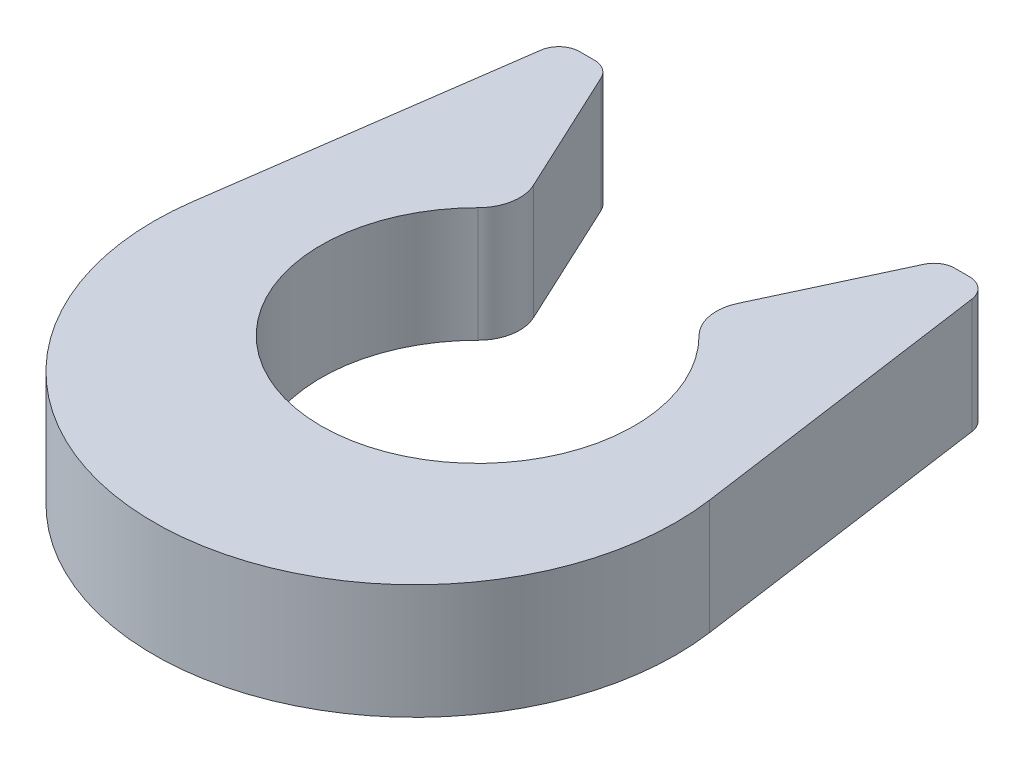
ISO-10303-21;
HEADER;
FILE_DESCRIPTION(('STEP AP214'),'2;1');
FILE_NAME('part.step','',(''),(''),'','','');
FILE_SCHEMA(('AUTOMOTIVE_DESIGN { 1 0 10303 214 1 1 1 1 }'));
ENDSEC;
DATA;
#1=APPLICATION_CONTEXT('core data for automotive mechanical design processes');
#2=APPLICATION_PROTOCOL_DEFINITION('international standard','automotive_design',2000,#1);
#3=PRODUCT_CONTEXT('',#1,'mechanical');
#4=PRODUCT('Part','Part','',(#3));
#5=PRODUCT_RELATED_PRODUCT_CATEGORY('part','',(#4));
#6=PRODUCT_DEFINITION_FORMATION('','',#4);
#7=PRODUCT_DEFINITION_CONTEXT('part definition',#1,'design');
#8=PRODUCT_DEFINITION('design','',#6,#7);
#9=PRODUCT_DEFINITION_SHAPE('','',#8);
#10=(LENGTH_UNIT() NAMED_UNIT(*) SI_UNIT(.MILLI.,.METRE.));
#11=(NAMED_UNIT(*) PLANE_ANGLE_UNIT() SI_UNIT($,.RADIAN.));
#12=(NAMED_UNIT(*) SI_UNIT($,.STERADIAN.) SOLID_ANGLE_UNIT());
#13=UNCERTAINTY_MEASURE_WITH_UNIT(LENGTH_MEASURE(1.E-05),#10,'distance_accuracy_value','');
#14=(GEOMETRIC_REPRESENTATION_CONTEXT(3) GLOBAL_UNCERTAINTY_ASSIGNED_CONTEXT((#13)) GLOBAL_UNIT_ASSIGNED_CONTEXT((#10,
#11,#12)) REPRESENTATION_CONTEXT('',''));
#15=CARTESIAN_POINT('',(0.,0.,0.));
#16=DIRECTION('',(0.,0.,1.));
#17=DIRECTION('',(1.,0.,0.));
#18=AXIS2_PLACEMENT_3D('',#15,#16,#17);
#19=CARTESIAN_POINT('',(0.,1.1,0.6));
#20=DIRECTION('',(0.,-1.,0.));
#21=DIRECTION('',(0.,0.,-1.));
#22=AXIS2_PLACEMENT_3D('',#19,#20,#21);
#23=CYLINDRICAL_SURFACE('',#22,2.5);
#24=CARTESIAN_POINT('',(0.,0.,0.6));
#25=DIRECTION('',(0.,1.,0.));
#26=DIRECTION('',(0.,0.,1.));
#27=AXIS2_PLACEMENT_3D('',#24,#25,#26);
#28=CIRCLE('',#27,2.5);
#29=CARTESIAN_POINT('',(-2.47567017185393,0.,0.252067247599854));
#30=VERTEX_POINT('',#29);
#31=CARTESIAN_POINT('',(2.47567017185393,0.,0.252067247599854));
#32=VERTEX_POINT('',#31);
#33=EDGE_CURVE('E141',#30,#32,#28,.T.);
#34=ORIENTED_EDGE('',*,*,#33,.T.);
#35=DIRECTION('',(0.,-1.,0.));
#36=VECTOR('',#35,1.);
#37=CARTESIAN_POINT('',(2.47567017185393,1.1,0.252067247599854));
#38=LINE('',#37,#36);
#39=CARTESIAN_POINT('',(2.47567017185393,1.1,0.252067247599854));
#40=VERTEX_POINT('',#39);
#41=EDGE_CURVE('E123',#40,#32,#38,.T.);
#42=ORIENTED_EDGE('',*,*,#41,.F.);
#43=CARTESIAN_POINT('',(0.,1.1,0.6));
#44=DIRECTION('',(0.,1.,0.));
#45=DIRECTION('',(0.,0.,1.));
#46=AXIS2_PLACEMENT_3D('',#43,#44,#45);
#47=CIRCLE('',#46,2.5);
#48=CARTESIAN_POINT('',(-2.47567017185393,1.1,0.252067247599854));
#49=VERTEX_POINT('',#48);
#50=EDGE_CURVE('E128',#49,#40,#47,.T.);
#51=ORIENTED_EDGE('',*,*,#50,.F.);
#52=DIRECTION('',(0.,-1.,0.));
#53=VECTOR('',#52,1.);
#54=CARTESIAN_POINT('',(-2.47567017185393,1.1,0.252067247599854));
#55=LINE('',#54,#53);
#56=EDGE_CURVE('E143',#49,#30,#55,.T.);
#57=ORIENTED_EDGE('',*,*,#56,.T.);
#58=EDGE_LOOP('',(#34,#42,#51,#57));
#59=FACE_BOUND('',#58,.T.);
#60=ADVANCED_FACE('F17',(#59),#23,.T.);
#61=CARTESIAN_POINT('',(2.04050400787065,1.1,-2.84430089981303));
#62=DIRECTION('',(-0.990268068741571,0.,0.139173100960059));
#63=DIRECTION('',(0.139173100960059,0.,0.990268068741571));
#64=AXIS2_PLACEMENT_3D('',#61,#62,#63);
#65=PLANE('',#64);
#66=DIRECTION('',(-0.139173100960059,0.,-0.990268068741571));
#67=VECTOR('',#66,1.);
#68=CARTESIAN_POINT('',(2.04050400787065,0.,-2.84430089981303));
#69=LINE('',#68,#67);
#70=CARTESIAN_POINT('',(2.06470027405571,0.,-2.67213552000503));
#71=VERTEX_POINT('',#70);
#72=EDGE_CURVE('E216',#32,#71,#69,.T.);
#73=ORIENTED_EDGE('',*,*,#72,.T.);
#74=DIRECTION('',(0.,-1.,0.));
#75=VECTOR('',#74,1.);
#76=CARTESIAN_POINT('',(2.06470027405571,1.1,-2.67213552000503));
#77=LINE('',#76,#75);
#78=CARTESIAN_POINT('',(2.06470027405571,1.1,-2.67213552000503));
#79=VERTEX_POINT('',#78);
#80=EDGE_CURVE('E126',#71,#79,#77,.F.);
#81=ORIENTED_EDGE('',*,*,#80,.T.);
#82=DIRECTION('',(-0.139173100960059,0.,-0.990268068741571));
#83=VECTOR('',#82,1.);
#84=CARTESIAN_POINT('',(2.04050400787065,1.1,-2.84430089981303));
#85=LINE('',#84,#83);
#86=EDGE_CURVE('E118',#40,#79,#85,.T.);
#87=ORIENTED_EDGE('',*,*,#86,.F.);
#88=ORIENTED_EDGE('',*,*,#41,.T.);
#89=EDGE_LOOP('',(#73,#81,#87,#88));
#90=FACE_BOUND('',#89,.T.);
#91=ADVANCED_FACE('F121',(#90),#65,.F.);
#92=CARTESIAN_POINT('',(1.6,1.1,-2.84430089981302));
#93=DIRECTION('',(0.,0.,1.));
#94=DIRECTION('',(1.,0.,0.));
#95=AXIS2_PLACEMENT_3D('',#92,#93,#94);
#96=PLANE('',#95);
#97=DIRECTION('',(-1.,0.,0.));
#98=VECTOR('',#97,1.);
#99=CARTESIAN_POINT('',(1.6,1.1,-2.84430089981302));
#100=LINE('',#99,#98);
#101=CARTESIAN_POINT('',(1.8666466603074,1.1,-2.84430089981302));
#102=VERTEX_POINT('',#101);
#103=CARTESIAN_POINT('',(1.7274140521615,1.1,-2.84430089981302));
#104=VERTEX_POINT('',#103);
#105=EDGE_CURVE('E127',#102,#104,#100,.T.);
#106=ORIENTED_EDGE('',*,*,#105,.F.);
#107=DIRECTION('',(0.,-1.,0.));
#108=VECTOR('',#107,1.);
#109=CARTESIAN_POINT('',(1.8666466603074,1.1,-2.84430089981302));
#110=LINE('',#109,#108);
#111=CARTESIAN_POINT('',(1.8666466603074,0.,-2.84430089981302));
#112=VERTEX_POINT('',#111);
#113=EDGE_CURVE('E191',#102,#112,#110,.T.);
#114=ORIENTED_EDGE('',*,*,#113,.T.);
#115=DIRECTION('',(-1.,0.,0.));
#116=VECTOR('',#115,1.);
#117=CARTESIAN_POINT('',(1.6,0.,-2.84430089981302));
#118=LINE('',#117,#116);
#119=CARTESIAN_POINT('',(1.7274140521615,0.,-2.84430089981302));
#120=VERTEX_POINT('',#119);
#121=EDGE_CURVE('E211',#112,#120,#118,.T.);
#122=ORIENTED_EDGE('',*,*,#121,.T.);
#123=DIRECTION('',(0.,-1.,0.));
#124=VECTOR('',#123,1.);
#125=CARTESIAN_POINT('',(1.7274140521615,1.1,-2.84430089981302));
#126=LINE('',#125,#124);
#127=EDGE_CURVE('E32',#120,#104,#126,.F.);
#128=ORIENTED_EDGE('',*,*,#127,.T.);
#129=EDGE_LOOP('',(#106,#114,#122,#128));
#130=FACE_BOUND('',#129,.T.);
#131=ADVANCED_FACE('F257',(#130),#96,.F.);
#132=CARTESIAN_POINT('',(0.85,1.1,-1.23592070943083));
#133=DIRECTION('',(0.906307787036652,0.,0.422618261740695));
#134=DIRECTION('',(0.422618261740695,0.,-0.906307787036652));
#135=AXIS2_PLACEMENT_3D('',#132,#133,#134);
#136=PLANE('',#135);
#137=DIRECTION('',(-0.422618261740695,0.,0.906307787036652));
#138=VECTOR('',#137,1.);
#139=CARTESIAN_POINT('',(0.85,1.1,-1.23592070943083));
#140=LINE('',#139,#138);
#141=CARTESIAN_POINT('',(1.54615249475417,1.1,-2.72882455216116));
#142=VERTEX_POINT('',#141);
#143=CARTESIAN_POINT('',(0.979625373790322,1.1,-1.51390322059781));
#144=VERTEX_POINT('',#143);
#145=EDGE_CURVE('E201',#142,#144,#140,.T.);
#146=ORIENTED_EDGE('',*,*,#145,.F.);
#147=DIRECTION('',(0.,-1.,0.));
#148=VECTOR('',#147,1.);
#149=CARTESIAN_POINT('',(1.54615249475417,1.1,-2.72882455216116));
#150=LINE('',#149,#148);
#151=CARTESIAN_POINT('',(1.54615249475417,0.,-2.72882455216116));
#152=VERTEX_POINT('',#151);
#153=EDGE_CURVE('E25',#142,#152,#150,.T.);
#154=ORIENTED_EDGE('',*,*,#153,.T.);
#155=DIRECTION('',(-0.422618261740695,0.,0.906307787036652));
#156=VECTOR('',#155,1.);
#157=CARTESIAN_POINT('',(0.85,0.,-1.23592070943083));
#158=LINE('',#157,#156);
#159=CARTESIAN_POINT('',(0.979625373790322,0.,-1.51390322059781));
#160=VERTEX_POINT('',#159);
#161=EDGE_CURVE('E200',#152,#160,#158,.T.);
#162=ORIENTED_EDGE('',*,*,#161,.T.);
#163=DIRECTION('',(0.,-1.,0.));
#164=VECTOR('',#163,1.);
#165=CARTESIAN_POINT('',(0.979625373790322,1.1,-1.51390322059781));
#166=LINE('',#165,#164);
#167=EDGE_CURVE('E157',#160,#144,#166,.F.);
#168=ORIENTED_EDGE('',*,*,#167,.T.);
#169=EDGE_LOOP('',(#146,#154,#162,#168));
#170=FACE_BOUND('',#169,.T.);
#171=ADVANCED_FACE('F199',(#170),#136,.F.);
#172=CARTESIAN_POINT('',(0.,1.1,0.));
#173=DIRECTION('',(0.,-1.,0.));
#174=DIRECTION('',(0.,0.,-1.));
#175=AXIS2_PLACEMENT_3D('',#172,#173,#174);
#176=CYLINDRICAL_SURFACE('',#175,1.5);
#177=CARTESIAN_POINT('',(0.,1.1,0.));
#178=DIRECTION('',(0.,-1.,0.));
#179=DIRECTION('',(0.,0.,1.));
#180=AXIS2_PLACEMENT_3D('',#177,#178,#179);
#181=CIRCLE('',#180,1.5);
#182=CARTESIAN_POINT('',(1.05959091205657,1.1,-1.06172835465911));
#183=VERTEX_POINT('',#182);
#184=CARTESIAN_POINT('',(-1.05959091205656,1.1,-1.06172835465911));
#185=VERTEX_POINT('',#184);
#186=EDGE_CURVE('E235',#183,#185,#181,.T.);
#187=ORIENTED_EDGE('',*,*,#186,.F.);
#188=DIRECTION('',(0.,-1.,0.));
#189=VECTOR('',#188,1.);
#190=CARTESIAN_POINT('',(1.05959091205657,1.1,-1.06172835465911));
#191=LINE('',#190,#189);
#192=CARTESIAN_POINT('',(1.05959091205657,0.,-1.06172835465911));
#193=VERTEX_POINT('',#192);
#194=EDGE_CURVE('E145',#183,#193,#191,.T.);
#195=ORIENTED_EDGE('',*,*,#194,.T.);
#196=CARTESIAN_POINT('',(0.,0.,0.));
#197=DIRECTION('',(0.,-1.,0.));
#198=DIRECTION('',(0.,0.,1.));
#199=AXIS2_PLACEMENT_3D('',#196,#197,#198);
#200=CIRCLE('',#199,1.5);
#201=CARTESIAN_POINT('',(-1.05959091205656,0.,-1.06172835465911));
#202=VERTEX_POINT('',#201);
#203=EDGE_CURVE('E210',#193,#202,#200,.T.);
#204=ORIENTED_EDGE('',*,*,#203,.T.);
#205=DIRECTION('',(0.,-1.,0.));
#206=VECTOR('',#205,1.);
#207=CARTESIAN_POINT('',(-1.05959091205657,1.1,-1.06172835465911));
#208=LINE('',#207,#206);
#209=EDGE_CURVE('E142',#202,#185,#208,.F.);
#210=ORIENTED_EDGE('',*,*,#209,.T.);
#211=EDGE_LOOP('',(#187,#195,#204,#210));
#212=FACE_BOUND('',#211,.T.);
#213=ADVANCED_FACE('F291',(#212),#176,.F.);
#214=CARTESIAN_POINT('',(-1.6,1.1,-2.84430089981302));
#215=DIRECTION('',(-0.906307787036652,0.,0.422618261740695));
#216=DIRECTION('',(0.422618261740695,0.,0.906307787036652));
#217=AXIS2_PLACEMENT_3D('',#214,#215,#216);
#218=PLANE('',#217);
#219=DIRECTION('',(-0.422618261740695,0.,-0.906307787036652));
#220=VECTOR('',#219,1.);
#221=CARTESIAN_POINT('',(-1.6,0.,-2.84430089981302));
#222=LINE('',#221,#220);
#223=CARTESIAN_POINT('',(-0.979625373790322,0.,-1.51390322059781));
#224=VERTEX_POINT('',#223);
#225=CARTESIAN_POINT('',(-1.54615249475417,0.,-2.72882455216116));
#226=VERTEX_POINT('',#225);
#227=EDGE_CURVE('E214',#224,#226,#222,.T.);
#228=ORIENTED_EDGE('',*,*,#227,.T.);
#229=DIRECTION('',(0.,-1.,0.));
#230=VECTOR('',#229,1.);
#231=CARTESIAN_POINT('',(-1.54615249475417,1.1,-2.72882455216116));
#232=LINE('',#231,#230);
#233=CARTESIAN_POINT('',(-1.54615249475417,1.1,-2.72882455216116));
#234=VERTEX_POINT('',#233);
#235=EDGE_CURVE('E11',#226,#234,#232,.F.);
#236=ORIENTED_EDGE('',*,*,#235,.T.);
#237=DIRECTION('',(-0.422618261740695,0.,-0.906307787036652));
#238=VECTOR('',#237,1.);
#239=CARTESIAN_POINT('',(-1.6,1.1,-2.84430089981302));
#240=LINE('',#239,#238);
#241=CARTESIAN_POINT('',(-0.979625373790322,1.1,-1.51390322059781));
#242=VERTEX_POINT('',#241);
#243=EDGE_CURVE('E232',#242,#234,#240,.T.);
#244=ORIENTED_EDGE('',*,*,#243,.F.);
#245=DIRECTION('',(0.,-1.,0.));
#246=VECTOR('',#245,1.);
#247=CARTESIAN_POINT('',(-0.979625373790322,1.1,-1.51390322059781));
#248=LINE('',#247,#246);
#249=EDGE_CURVE('E164',#242,#224,#248,.T.);
#250=ORIENTED_EDGE('',*,*,#249,.T.);
#251=EDGE_LOOP('',(#228,#236,#244,#250));
#252=FACE_BOUND('',#251,.T.);
#253=ADVANCED_FACE('F284',(#252),#218,.F.);
#254=CARTESIAN_POINT('',(-2.04050400787065,1.1,-2.84430089981303));
#255=DIRECTION('',(0.,0.,1.));
#256=DIRECTION('',(1.,0.,0.));
#257=AXIS2_PLACEMENT_3D('',#254,#255,#256);
#258=PLANE('',#257);
#259=DIRECTION('',(-1.,0.,0.));
#260=VECTOR('',#259,1.);
#261=CARTESIAN_POINT('',(-2.04050400787065,0.,-2.84430089981303));
#262=LINE('',#261,#260);
#263=CARTESIAN_POINT('',(-1.7274140521615,0.,-2.84430089981302));
#264=VERTEX_POINT('',#263);
#265=CARTESIAN_POINT('',(-1.8666466603074,0.,-2.84430089981302));
#266=VERTEX_POINT('',#265);
#267=EDGE_CURVE('E222',#264,#266,#262,.T.);
#268=ORIENTED_EDGE('',*,*,#267,.T.);
#269=DIRECTION('',(0.,-1.,0.));
#270=VECTOR('',#269,1.);
#271=CARTESIAN_POINT('',(-1.8666466603074,1.1,-2.84430089981302));
#272=LINE('',#271,#270);
#273=CARTESIAN_POINT('',(-1.8666466603074,1.1,-2.84430089981302));
#274=VERTEX_POINT('',#273);
#275=EDGE_CURVE('E181',#266,#274,#272,.F.);
#276=ORIENTED_EDGE('',*,*,#275,.T.);
#277=DIRECTION('',(-1.,0.,0.));
#278=VECTOR('',#277,1.);
#279=CARTESIAN_POINT('',(-2.04050400787065,1.1,-2.84430089981303));
#280=LINE('',#279,#278);
#281=CARTESIAN_POINT('',(-1.7274140521615,1.1,-2.84430089981302));
#282=VERTEX_POINT('',#281);
#283=EDGE_CURVE('E230',#282,#274,#280,.T.);
#284=ORIENTED_EDGE('',*,*,#283,.F.);
#285=DIRECTION('',(0.,-1.,0.));
#286=VECTOR('',#285,1.);
#287=CARTESIAN_POINT('',(-1.7274140521615,1.1,-2.84430089981302));
#288=LINE('',#287,#286);
#289=EDGE_CURVE('E178',#282,#264,#288,.T.);
#290=ORIENTED_EDGE('',*,*,#289,.T.);
#291=EDGE_LOOP('',(#268,#276,#284,#290));
#292=FACE_BOUND('',#291,.T.);
#293=ADVANCED_FACE('F279',(#292),#258,.F.);
#294=CARTESIAN_POINT('',(-2.47567017185393,1.1,0.252067247599854));
#295=DIRECTION('',(0.990268068741571,0.,0.139173100960058));
#296=DIRECTION('',(0.139173100960058,0.,-0.990268068741571));
#297=AXIS2_PLACEMENT_3D('',#294,#295,#296);
#298=PLANE('',#297);
#299=DIRECTION('',(-0.139173100960058,0.,0.990268068741571));
#300=VECTOR('',#299,1.);
#301=CARTESIAN_POINT('',(-2.47567017185393,1.1,0.252067247599854));
#302=LINE('',#301,#300);
#303=CARTESIAN_POINT('',(-2.06470027405571,1.1,-2.67213552000503));
#304=VERTEX_POINT('',#303);
#305=EDGE_CURVE('E134',#304,#49,#302,.T.);
#306=ORIENTED_EDGE('',*,*,#305,.F.);
#307=DIRECTION('',(0.,-1.,0.));
#308=VECTOR('',#307,1.);
#309=CARTESIAN_POINT('',(-2.06470027405571,1.1,-2.67213552000503));
#310=LINE('',#309,#308);
#311=CARTESIAN_POINT('',(-2.06470027405571,0.,-2.67213552000503));
#312=VERTEX_POINT('',#311);
#313=EDGE_CURVE('E167',#304,#312,#310,.T.);
#314=ORIENTED_EDGE('',*,*,#313,.T.);
#315=DIRECTION('',(-0.139173100960058,0.,0.990268068741571));
#316=VECTOR('',#315,1.);
#317=CARTESIAN_POINT('',(-2.47567017185393,0.,0.252067247599854));
#318=LINE('',#317,#316);
#319=EDGE_CURVE('E138',#312,#30,#318,.T.);
#320=ORIENTED_EDGE('',*,*,#319,.T.);
#321=ORIENTED_EDGE('',*,*,#56,.F.);
#322=EDGE_LOOP('',(#306,#314,#320,#321));
#323=FACE_BOUND('',#322,.T.);
#324=ADVANCED_FACE('F225',(#323),#298,.F.);
#325=CARTESIAN_POINT('',(0.,1.1,0.6));
#326=DIRECTION('',(0.,1.,0.));
#327=DIRECTION('',(0.,0.,1.));
#328=AXIS2_PLACEMENT_3D('',#325,#326,#327);
#329=PLANE('',#328);
#330=ORIENTED_EDGE('',*,*,#283,.T.);
#331=CARTESIAN_POINT('',(-1.8666466603074,1.1,-2.64430089981302));
#332=DIRECTION('',(0.,1.,0.));
#333=DIRECTION('',(0.,0.,1.));
#334=AXIS2_PLACEMENT_3D('',#331,#332,#333);
#335=CIRCLE('',#334,0.2);
#336=EDGE_CURVE('E188',#274,#304,#335,.T.);
#337=ORIENTED_EDGE('',*,*,#336,.T.);
#338=ORIENTED_EDGE('',*,*,#305,.T.);
#339=ORIENTED_EDGE('',*,*,#50,.T.);
#340=ORIENTED_EDGE('',*,*,#86,.T.);
#341=CARTESIAN_POINT('',(1.8666466603074,1.1,-2.64430089981302));
#342=DIRECTION('',(0.,1.,0.));
#343=DIRECTION('',(0.,0.,1.));
#344=AXIS2_PLACEMENT_3D('',#341,#342,#343);
#345=CIRCLE('',#344,0.2);
#346=EDGE_CURVE('E39',#79,#102,#345,.T.);
#347=ORIENTED_EDGE('',*,*,#346,.T.);
#348=ORIENTED_EDGE('',*,*,#105,.T.);
#349=CARTESIAN_POINT('',(1.7274140521615,1.1,-2.64430089981302));
#350=DIRECTION('',(0.,1.,0.));
#351=DIRECTION('',(0.,0.,1.));
#352=AXIS2_PLACEMENT_3D('',#349,#350,#351);
#353=CIRCLE('',#352,0.2);
#354=EDGE_CURVE('E185',#104,#142,#353,.T.);
#355=ORIENTED_EDGE('',*,*,#354,.T.);
#356=ORIENTED_EDGE('',*,*,#145,.T.);
#357=CARTESIAN_POINT('',(1.34214848860498,1.1,-1.34485591590154));
#358=DIRECTION('',(0.,1.,0.));
#359=DIRECTION('',(0.,0.,1.));
#360=AXIS2_PLACEMENT_3D('',#357,#358,#359);
#361=CIRCLE('',#360,0.4);
#362=EDGE_CURVE('E162',#144,#183,#361,.T.);
#363=ORIENTED_EDGE('',*,*,#362,.T.);
#364=ORIENTED_EDGE('',*,*,#186,.T.);
#365=CARTESIAN_POINT('',(-1.34214848860498,1.1,-1.34485591590154));
#366=DIRECTION('',(0.,1.,0.));
#367=DIRECTION('',(0.,0.,1.));
#368=AXIS2_PLACEMENT_3D('',#365,#366,#367);
#369=CIRCLE('',#368,0.4);
#370=EDGE_CURVE('E160',#185,#242,#369,.T.);
#371=ORIENTED_EDGE('',*,*,#370,.T.);
#372=ORIENTED_EDGE('',*,*,#243,.T.);
#373=CARTESIAN_POINT('',(-1.7274140521615,1.1,-2.64430089981302));
#374=DIRECTION('',(0.,1.,0.));
#375=DIRECTION('',(0.,0.,1.));
#376=AXIS2_PLACEMENT_3D('',#373,#374,#375);
#377=CIRCLE('',#376,0.2);
#378=EDGE_CURVE('E183',#234,#282,#377,.T.);
#379=ORIENTED_EDGE('',*,*,#378,.T.);
#380=EDGE_LOOP('',(#330,#337,#338,#339,#340,#347,#348,#355,#356,#363,#364,#371,#372,#379));
#381=FACE_BOUND('',#380,.T.);
#382=ADVANCED_FACE('F132',(#381),#329,.T.);
#383=CARTESIAN_POINT('',(0.,0.,0.6));
#384=DIRECTION('',(0.,1.,0.));
#385=DIRECTION('',(0.,0.,1.));
#386=AXIS2_PLACEMENT_3D('',#383,#384,#385);
#387=PLANE('',#386);
#388=ORIENTED_EDGE('',*,*,#319,.F.);
#389=CARTESIAN_POINT('',(-1.8666466603074,0.,-2.64430089981302));
#390=DIRECTION('',(0.,1.,0.));
#391=DIRECTION('',(0.,0.,1.));
#392=AXIS2_PLACEMENT_3D('',#389,#390,#391);
#393=CIRCLE('',#392,0.2);
#394=EDGE_CURVE('E176',#312,#266,#393,.F.);
#395=ORIENTED_EDGE('',*,*,#394,.T.);
#396=ORIENTED_EDGE('',*,*,#267,.F.);
#397=CARTESIAN_POINT('',(-1.7274140521615,0.,-2.64430089981302));
#398=DIRECTION('',(0.,1.,0.));
#399=DIRECTION('',(0.,0.,1.));
#400=AXIS2_PLACEMENT_3D('',#397,#398,#399);
#401=CIRCLE('',#400,0.2);
#402=EDGE_CURVE('E170',#264,#226,#401,.F.);
#403=ORIENTED_EDGE('',*,*,#402,.T.);
#404=ORIENTED_EDGE('',*,*,#227,.F.);
#405=CARTESIAN_POINT('',(-1.34214848860498,0.,-1.34485591590154));
#406=DIRECTION('',(0.,1.,0.));
#407=DIRECTION('',(0.,0.,1.));
#408=AXIS2_PLACEMENT_3D('',#405,#406,#407);
#409=CIRCLE('',#408,0.4);
#410=EDGE_CURVE('E152',#224,#202,#409,.F.);
#411=ORIENTED_EDGE('',*,*,#410,.T.);
#412=ORIENTED_EDGE('',*,*,#203,.F.);
#413=CARTESIAN_POINT('',(1.34214848860498,0.,-1.34485591590154));
#414=DIRECTION('',(0.,1.,0.));
#415=DIRECTION('',(0.,0.,1.));
#416=AXIS2_PLACEMENT_3D('',#413,#414,#415);
#417=CIRCLE('',#416,0.4);
#418=EDGE_CURVE('E154',#193,#160,#417,.F.);
#419=ORIENTED_EDGE('',*,*,#418,.T.);
#420=ORIENTED_EDGE('',*,*,#161,.F.);
#421=CARTESIAN_POINT('',(1.7274140521615,0.,-2.64430089981302));
#422=DIRECTION('',(0.,1.,0.));
#423=DIRECTION('',(0.,0.,1.));
#424=AXIS2_PLACEMENT_3D('',#421,#422,#423);
#425=CIRCLE('',#424,0.2);
#426=EDGE_CURVE('E172',#152,#120,#425,.F.);
#427=ORIENTED_EDGE('',*,*,#426,.T.);
#428=ORIENTED_EDGE('',*,*,#121,.F.);
#429=CARTESIAN_POINT('',(1.8666466603074,0.,-2.64430089981302));
#430=DIRECTION('',(0.,1.,0.));
#431=DIRECTION('',(0.,0.,1.));
#432=AXIS2_PLACEMENT_3D('',#429,#430,#431);
#433=CIRCLE('',#432,0.2);
#434=EDGE_CURVE('E174',#112,#71,#433,.F.);
#435=ORIENTED_EDGE('',*,*,#434,.T.);
#436=ORIENTED_EDGE('',*,*,#72,.F.);
#437=ORIENTED_EDGE('',*,*,#33,.F.);
#438=EDGE_LOOP('',(#388,#395,#396,#403,#404,#411,#412,#419,#420,#427,#428,#435,#436,#437));
#439=FACE_BOUND('',#438,.T.);
#440=ADVANCED_FACE('F206',(#439),#387,.F.);
#441=CARTESIAN_POINT('',(1.34214848860498,1.1,-1.34485591590154));
#442=DIRECTION('',(0.,-1.,0.));
#443=DIRECTION('',(0.,0.,-1.));
#444=AXIS2_PLACEMENT_3D('',#441,#442,#443);
#445=CYLINDRICAL_SURFACE('',#444,0.4);
#446=ORIENTED_EDGE('',*,*,#362,.F.);
#447=ORIENTED_EDGE('',*,*,#167,.F.);
#448=ORIENTED_EDGE('',*,*,#418,.F.);
#449=ORIENTED_EDGE('',*,*,#194,.F.);
#450=EDGE_LOOP('',(#446,#447,#448,#449));
#451=FACE_BOUND('',#450,.T.);
#452=ADVANCED_FACE('F261',(#451),#445,.T.);
#453=CARTESIAN_POINT('',(-1.34214848860498,1.1,-1.34485591590154));
#454=DIRECTION('',(0.,-1.,0.));
#455=DIRECTION('',(0.,0.,-1.));
#456=AXIS2_PLACEMENT_3D('',#453,#454,#455);
#457=CYLINDRICAL_SURFACE('',#456,0.4);
#458=ORIENTED_EDGE('',*,*,#370,.F.);
#459=ORIENTED_EDGE('',*,*,#209,.F.);
#460=ORIENTED_EDGE('',*,*,#410,.F.);
#461=ORIENTED_EDGE('',*,*,#249,.F.);
#462=EDGE_LOOP('',(#458,#459,#460,#461));
#463=FACE_BOUND('',#462,.T.);
#464=ADVANCED_FACE('F264',(#463),#457,.T.);
#465=CARTESIAN_POINT('',(-1.8666466603074,1.1,-2.64430089981302));
#466=DIRECTION('',(0.,-1.,0.));
#467=DIRECTION('',(0.,0.,-1.));
#468=AXIS2_PLACEMENT_3D('',#465,#466,#467);
#469=CYLINDRICAL_SURFACE('',#468,0.2);
#470=ORIENTED_EDGE('',*,*,#336,.F.);
#471=ORIENTED_EDGE('',*,*,#275,.F.);
#472=ORIENTED_EDGE('',*,*,#394,.F.);
#473=ORIENTED_EDGE('',*,*,#313,.F.);
#474=EDGE_LOOP('',(#470,#471,#472,#473));
#475=FACE_BOUND('',#474,.T.);
#476=ADVANCED_FACE('F249',(#475),#469,.T.);
#477=CARTESIAN_POINT('',(1.8666466603074,1.1,-2.64430089981302));
#478=DIRECTION('',(0.,-1.,0.));
#479=DIRECTION('',(0.,0.,-1.));
#480=AXIS2_PLACEMENT_3D('',#477,#478,#479);
#481=CYLINDRICAL_SURFACE('',#480,0.2);
#482=ORIENTED_EDGE('',*,*,#346,.F.);
#483=ORIENTED_EDGE('',*,*,#80,.F.);
#484=ORIENTED_EDGE('',*,*,#434,.F.);
#485=ORIENTED_EDGE('',*,*,#113,.F.);
#486=EDGE_LOOP('',(#482,#483,#484,#485));
#487=FACE_BOUND('',#486,.T.);
#488=ADVANCED_FACE('F242',(#487),#481,.T.);
#489=CARTESIAN_POINT('',(1.7274140521615,1.1,-2.64430089981302));
#490=DIRECTION('',(0.,-1.,0.));
#491=DIRECTION('',(0.,0.,-1.));
#492=AXIS2_PLACEMENT_3D('',#489,#490,#491);
#493=CYLINDRICAL_SURFACE('',#492,0.2);
#494=ORIENTED_EDGE('',*,*,#354,.F.);
#495=ORIENTED_EDGE('',*,*,#127,.F.);
#496=ORIENTED_EDGE('',*,*,#426,.F.);
#497=ORIENTED_EDGE('',*,*,#153,.F.);
#498=EDGE_LOOP('',(#494,#495,#496,#497));
#499=FACE_BOUND('',#498,.T.);
#500=ADVANCED_FACE('F240',(#499),#493,.T.);
#501=CARTESIAN_POINT('',(-1.7274140521615,1.1,-2.64430089981302));
#502=DIRECTION('',(0.,-1.,0.));
#503=DIRECTION('',(0.,0.,-1.));
#504=AXIS2_PLACEMENT_3D('',#501,#502,#503);
#505=CYLINDRICAL_SURFACE('',#504,0.2);
#506=ORIENTED_EDGE('',*,*,#378,.F.);
#507=ORIENTED_EDGE('',*,*,#235,.F.);
#508=ORIENTED_EDGE('',*,*,#402,.F.);
#509=ORIENTED_EDGE('',*,*,#289,.F.);
#510=EDGE_LOOP('',(#506,#507,#508,#509));
#511=FACE_BOUND('',#510,.T.);
#512=ADVANCED_FACE('F19',(#511),#505,.T.);
#513=CLOSED_SHELL('',(#60,#91,#131,#171,#213,#253,#293,#324,#382,#440,#452,#464,#476,#488,#500,#512));
#514=MANIFOLD_SOLID_BREP('B1',#513);
#515=ADVANCED_BREP_SHAPE_REPRESENTATION('',(#18,#514),#14);
#516=SHAPE_DEFINITION_REPRESENTATION(#9,#515);
ENDSEC;
END-ISO-10303-21;
